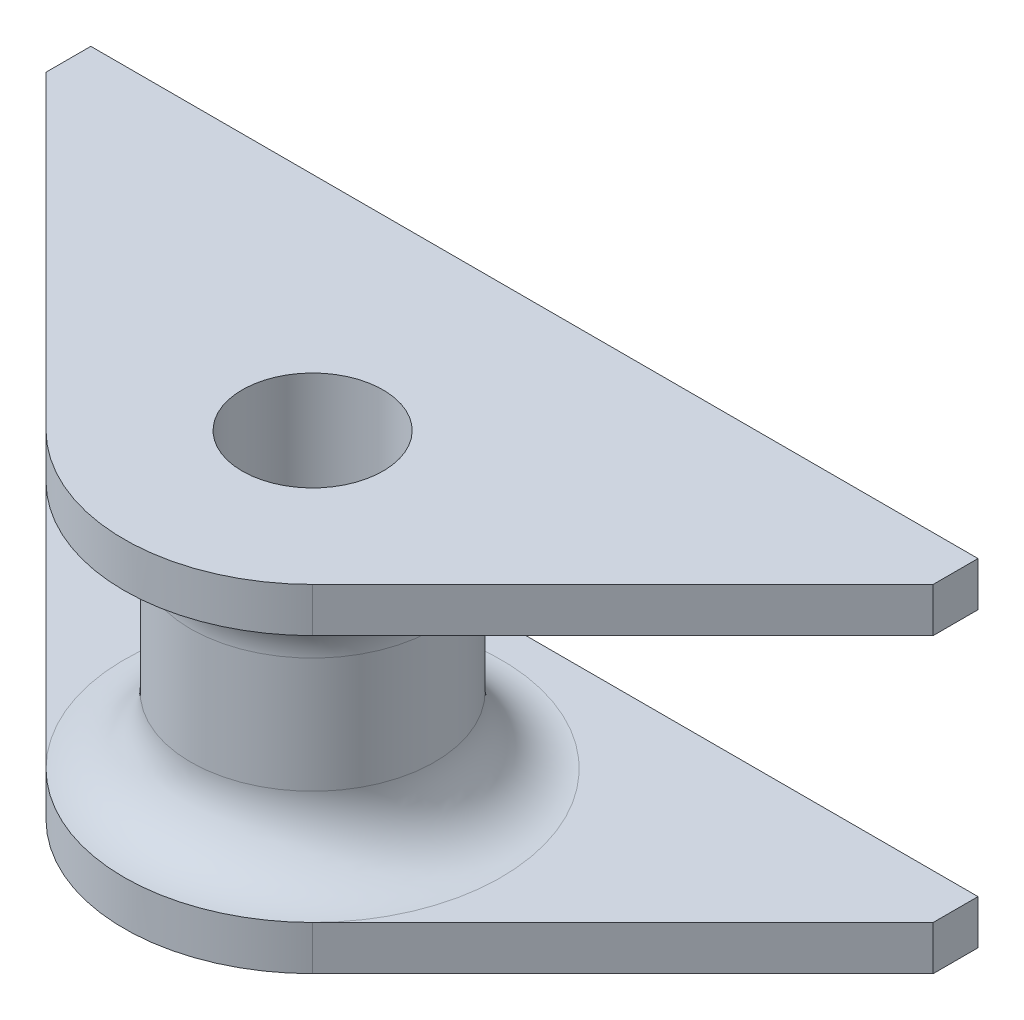
ISO-10303-21;
HEADER;
FILE_DESCRIPTION(('STEP AP214'),'2;1');
FILE_NAME('part.step','',(''),(''),'','','');
FILE_SCHEMA(('AUTOMOTIVE_DESIGN { 1 0 10303 214 1 1 1 1 }'));
ENDSEC;
DATA;
#1=APPLICATION_CONTEXT('core data for automotive mechanical design processes');
#2=APPLICATION_PROTOCOL_DEFINITION('international standard','automotive_design',2000,#1);
#3=PRODUCT_CONTEXT('',#1,'mechanical');
#4=PRODUCT('Part','Part','',(#3));
#5=PRODUCT_RELATED_PRODUCT_CATEGORY('part','',(#4));
#6=PRODUCT_DEFINITION_FORMATION('','',#4);
#7=PRODUCT_DEFINITION_CONTEXT('part definition',#1,'design');
#8=PRODUCT_DEFINITION('design','',#6,#7);
#9=PRODUCT_DEFINITION_SHAPE('','',#8);
#10=(LENGTH_UNIT() NAMED_UNIT(*) SI_UNIT(.MILLI.,.METRE.));
#11=(NAMED_UNIT(*) PLANE_ANGLE_UNIT() SI_UNIT($,.RADIAN.));
#12=(NAMED_UNIT(*) SI_UNIT($,.STERADIAN.) SOLID_ANGLE_UNIT());
#13=UNCERTAINTY_MEASURE_WITH_UNIT(LENGTH_MEASURE(1.E-05),#10,'distance_accuracy_value','');
#14=(GEOMETRIC_REPRESENTATION_CONTEXT(3) GLOBAL_UNCERTAINTY_ASSIGNED_CONTEXT((#13)) GLOBAL_UNIT_ASSIGNED_CONTEXT((#10,
#11,#12)) REPRESENTATION_CONTEXT('',''));
#15=CARTESIAN_POINT('',(0.,0.,0.));
#16=DIRECTION('',(0.,0.,1.));
#17=DIRECTION('',(1.,0.,0.));
#18=AXIS2_PLACEMENT_3D('',#15,#16,#17);
#19=CARTESIAN_POINT('',(0.,-7.6,0.));
#20=DIRECTION('',(0.,1.,0.));
#21=DIRECTION('',(0.,0.,1.));
#22=AXIS2_PLACEMENT_3D('',#19,#20,#21);
#23=CYLINDRICAL_SURFACE('',#22,5.5);
#24=CARTESIAN_POINT('',(0.,2.6,0.));
#25=DIRECTION('',(0.,1.,0.));
#26=DIRECTION('',(0.,0.,1.));
#27=AXIS2_PLACEMENT_3D('',#24,#25,#26);
#28=CIRCLE('',#27,5.5);
#29=CARTESIAN_POINT('',(0.,2.6,5.5));
#30=VERTEX_POINT('',#29);
#31=EDGE_CURVE('E47',#30,#30,#28,.F.);
#32=CARTESIAN_POINT('',(0.,-2.6,0.));
#33=DIRECTION('',(0.,1.,0.));
#34=DIRECTION('',(0.,0.,1.));
#35=AXIS2_PLACEMENT_3D('',#32,#33,#34);
#36=CIRCLE('',#35,5.5);
#37=CARTESIAN_POINT('',(0.,-2.6,5.5));
#38=VERTEX_POINT('',#37);
#39=EDGE_CURVE('E163',#38,#38,#36,.T.);
#40=CARTESIAN_POINT('',(0.,2.6,5.5));
#41=CARTESIAN_POINT('',(0.,2.54583333333333,5.5));
#42=CARTESIAN_POINT('',(0.,2.49166666666667,5.5));
#43=CARTESIAN_POINT('',(0.,2.38333333333333,5.5));
#44=CARTESIAN_POINT('',(0.,2.32916666666667,5.5));
#45=CARTESIAN_POINT('',(0.,2.22083333333333,5.5));
#46=CARTESIAN_POINT('',(0.,2.16666666666667,5.5));
#47=CARTESIAN_POINT('',(0.,2.05833333333333,5.5));
#48=CARTESIAN_POINT('',(0.,2.00416666666667,5.5));
#49=CARTESIAN_POINT('',(0.,1.89583333333333,5.5));
#50=CARTESIAN_POINT('',(0.,1.84166666666667,5.5));
#51=CARTESIAN_POINT('',(0.,1.73333333333333,5.5));
#52=CARTESIAN_POINT('',(0.,1.67916666666667,5.5));
#53=CARTESIAN_POINT('',(0.,1.57083333333333,5.5));
#54=CARTESIAN_POINT('',(0.,1.51666666666667,5.5));
#55=CARTESIAN_POINT('',(0.,1.40833333333333,5.5));
#56=CARTESIAN_POINT('',(0.,1.35416666666667,5.5));
#57=CARTESIAN_POINT('',(0.,1.24583333333333,5.5));
#58=CARTESIAN_POINT('',(0.,1.19166666666667,5.5));
#59=CARTESIAN_POINT('',(0.,1.08333333333333,5.5));
#60=CARTESIAN_POINT('',(0.,1.02916666666666,5.5));
#61=CARTESIAN_POINT('',(0.,0.920833333333331,5.5));
#62=CARTESIAN_POINT('',(0.,0.866666666666665,5.5));
#63=CARTESIAN_POINT('',(0.,0.758333333333332,5.5));
#64=CARTESIAN_POINT('',(0.,0.704166666666665,5.5));
#65=CARTESIAN_POINT('',(0.,0.595833333333332,5.5));
#66=CARTESIAN_POINT('',(0.,0.541666666666666,5.5));
#67=CARTESIAN_POINT('',(0.,0.433333333333332,5.5));
#68=CARTESIAN_POINT('',(0.,0.379166666666665,5.5));
#69=CARTESIAN_POINT('',(0.,0.270833333333332,5.5));
#70=CARTESIAN_POINT('',(0.,0.216666666666666,5.5));
#71=CARTESIAN_POINT('',(0.,0.108333333333333,5.5));
#72=CARTESIAN_POINT('',(0.,0.0541666666666659,5.5));
#73=CARTESIAN_POINT('',(0.,-0.0541666666666677,5.5));
#74=CARTESIAN_POINT('',(0.,-0.108333333333334,5.5));
#75=CARTESIAN_POINT('',(0.,-0.216666666666668,5.5));
#76=CARTESIAN_POINT('',(0.,-0.270833333333334,5.5));
#77=CARTESIAN_POINT('',(0.,-0.379166666666667,5.5));
#78=CARTESIAN_POINT('',(0.,-0.433333333333334,5.5));
#79=CARTESIAN_POINT('',(0.,-0.541666666666668,5.5));
#80=CARTESIAN_POINT('',(0.,-0.595833333333335,5.5));
#81=CARTESIAN_POINT('',(0.,-0.704166666666668,5.5));
#82=CARTESIAN_POINT('',(0.,-0.758333333333334,5.5));
#83=CARTESIAN_POINT('',(0.,-0.866666666666667,5.5));
#84=CARTESIAN_POINT('',(0.,-0.920833333333334,5.5));
#85=CARTESIAN_POINT('',(0.,-1.02916666666667,5.5));
#86=CARTESIAN_POINT('',(0.,-1.08333333333333,5.5));
#87=CARTESIAN_POINT('',(0.,-1.19166666666667,5.5));
#88=CARTESIAN_POINT('',(0.,-1.24583333333333,5.5));
#89=CARTESIAN_POINT('',(0.,-1.35416666666667,5.5));
#90=CARTESIAN_POINT('',(0.,-1.40833333333333,5.5));
#91=CARTESIAN_POINT('',(0.,-1.51666666666667,5.5));
#92=CARTESIAN_POINT('',(0.,-1.57083333333333,5.5));
#93=CARTESIAN_POINT('',(0.,-1.67916666666667,5.5));
#94=CARTESIAN_POINT('',(0.,-1.73333333333333,5.5));
#95=CARTESIAN_POINT('',(0.,-1.84166666666667,5.5));
#96=CARTESIAN_POINT('',(0.,-1.89583333333333,5.5));
#97=CARTESIAN_POINT('',(0.,-2.00416666666667,5.5));
#98=CARTESIAN_POINT('',(0.,-2.05833333333333,5.5));
#99=CARTESIAN_POINT('',(0.,-2.16666666666667,5.5));
#100=CARTESIAN_POINT('',(0.,-2.22083333333333,5.5));
#101=CARTESIAN_POINT('',(0.,-2.32916666666667,5.5));
#102=CARTESIAN_POINT('',(0.,-2.38333333333334,5.5));
#103=CARTESIAN_POINT('',(0.,-2.49166666666667,5.5));
#104=CARTESIAN_POINT('',(0.,-2.54583333333333,5.5));
#105=CARTESIAN_POINT('',(0.,-2.6,5.5));
#106=B_SPLINE_CURVE_WITH_KNOTS('',3,(#40,#41,#42,#43,#44,#45,#46,#47,#48,#49,#50,#51,#52,#53,
#54,#55,#56,#57,#58,#59,#60,#61,#62,#63,#64,#65,#66,#67,#68,#69,#70,#71,#72,#73,#74,#75,#76,#77,
#78,#79,#80,#81,#82,#83,#84,#85,#86,#87,#88,#89,#90,#91,#92,#93,#94,#95,#96,#97,#98,#99,#100,
#101,#102,#103,#104,#105),.UNSPECIFIED.,.F.,.F.,(4,2,2,2,2,2,2,2,2,2,2,2,2,2,2,2,2,2,2,2,2,2,2,
2,2,2,2,2,2,2,2,2,4),(0.,0.162499999999999,0.325000000000001,0.4875,0.65,0.812500000000001,
0.975,1.1375,1.3,1.4625,1.625,1.7875,1.95,2.1125,2.275,2.4375,2.6,2.7625,2.925,3.0875,3.25,
3.4125,3.575,3.7375,3.9,4.0625,4.225,4.3875,4.55,4.7125,4.875,5.0375,5.2),.UNSPECIFIED.);
#107=EDGE_CURVE('BSEAM38',#30,#38,#106,.T.);
#108=ORIENTED_EDGE('',*,*,#31,.T.);
#109=ORIENTED_EDGE('',*,*,#39,.T.);
#110=ORIENTED_EDGE('',*,*,#107,.T.);
#111=ORIENTED_EDGE('',*,*,#107,.F.);
#112=EDGE_LOOP('',(#108,#110,#109,#111));
#113=FACE_BOUND('',#112,.T.);
#114=ADVANCED_FACE('F38',(#113),#23,.T.);
#115=CARTESIAN_POINT('',(0.,-7.6,0.));
#116=DIRECTION('',(0.,1.,0.));
#117=DIRECTION('',(0.,0.,1.));
#118=AXIS2_PLACEMENT_3D('',#115,#116,#117);
#119=PLANE('',#118);
#120=CARTESIAN_POINT('',(0.,-7.6,0.));
#121=DIRECTION('',(0.,1.,0.));
#122=DIRECTION('',(0.,0.,1.));
#123=AXIS2_PLACEMENT_3D('',#120,#121,#122);
#124=CIRCLE('',#123,3.175);
#125=CARTESIAN_POINT('',(0.,-7.6,3.175));
#126=VERTEX_POINT('',#125);
#127=EDGE_CURVE('E158',#126,#126,#124,.T.);
#128=ORIENTED_EDGE('',*,*,#127,.T.);
#129=EDGE_LOOP('',(#128));
#130=FACE_BOUND('',#129,.T.);
#131=CARTESIAN_POINT('',(0.,-7.6,0.));
#132=DIRECTION('',(0.,1.,0.));
#133=DIRECTION('',(0.,0.,1.));
#134=AXIS2_PLACEMENT_3D('',#131,#132,#133);
#135=CIRCLE('',#134,8.5);
#136=CARTESIAN_POINT('',(-6.01040764008566,-7.6,6.01040764008566));
#137=VERTEX_POINT('',#136);
#138=CARTESIAN_POINT('',(6.01040764008566,-7.6,6.01040764008566));
#139=VERTEX_POINT('',#138);
#140=EDGE_CURVE('E286',#137,#139,#135,.T.);
#141=ORIENTED_EDGE('',*,*,#140,.F.);
#142=DIRECTION('',(0.707106781186548,0.,0.707106781186547));
#143=VECTOR('',#142,1.);
#144=CARTESIAN_POINT('',(-20.,-7.6,-7.97918471982869));
#145=LINE('',#144,#143);
#146=CARTESIAN_POINT('',(-20.,-7.6,-7.97918471982869));
#147=VERTEX_POINT('',#146);
#148=EDGE_CURVE('E264',#147,#137,#145,.T.);
#149=ORIENTED_EDGE('',*,*,#148,.F.);
#150=DIRECTION('',(0.,0.,1.));
#151=VECTOR('',#150,1.);
#152=CARTESIAN_POINT('',(-20.,-7.6,-10.));
#153=LINE('',#152,#151);
#154=CARTESIAN_POINT('',(-20.,-7.6,-10.));
#155=VERTEX_POINT('',#154);
#156=EDGE_CURVE('E278',#155,#147,#153,.T.);
#157=ORIENTED_EDGE('',*,*,#156,.F.);
#158=DIRECTION('',(-1.,0.,0.));
#159=VECTOR('',#158,1.);
#160=CARTESIAN_POINT('',(-20.,-7.6,-10.));
#161=LINE('',#160,#159);
#162=CARTESIAN_POINT('',(20.,-7.6,-10.));
#163=VERTEX_POINT('',#162);
#164=EDGE_CURVE('E294',#163,#155,#161,.T.);
#165=ORIENTED_EDGE('',*,*,#164,.F.);
#166=DIRECTION('',(0.,0.,-1.));
#167=VECTOR('',#166,1.);
#168=CARTESIAN_POINT('',(20.,-7.6,-7.97918471982869));
#169=LINE('',#168,#167);
#170=CARTESIAN_POINT('',(20.,-7.6,-7.97918471982869));
#171=VERTEX_POINT('',#170);
#172=EDGE_CURVE('E291',#171,#163,#169,.T.);
#173=ORIENTED_EDGE('',*,*,#172,.F.);
#174=DIRECTION('',(0.707106781186548,0.,-0.707106781186547));
#175=VECTOR('',#174,1.);
#176=CARTESIAN_POINT('',(6.01040764008566,-7.6,6.01040764008566));
#177=LINE('',#176,#175);
#178=EDGE_CURVE('E288',#139,#171,#177,.T.);
#179=ORIENTED_EDGE('',*,*,#178,.F.);
#180=EDGE_LOOP('',(#141,#149,#157,#165,#173,#179));
#181=FACE_BOUND('',#180,.T.);
#182=ADVANCED_FACE('F183',(#130,#181),#119,.F.);
#183=CARTESIAN_POINT('',(0.,-7.6,0.));
#184=DIRECTION('',(0.,1.,0.));
#185=DIRECTION('',(0.,0.,1.));
#186=AXIS2_PLACEMENT_3D('',#183,#184,#185);
#187=CYLINDRICAL_SURFACE('',#186,3.175);
#188=CARTESIAN_POINT('',(0.,7.6,0.));
#189=DIRECTION('',(0.,1.,0.));
#190=DIRECTION('',(0.,0.,1.));
#191=AXIS2_PLACEMENT_3D('',#188,#189,#190);
#192=CIRCLE('',#191,3.175);
#193=CARTESIAN_POINT('',(0.,7.6,3.175));
#194=VERTEX_POINT('',#193);
#195=EDGE_CURVE('E150',#194,#194,#192,.T.);
#196=CARTESIAN_POINT('',(0.,-7.6,3.175));
#197=CARTESIAN_POINT('',(0.,-7.44166666666667,3.175));
#198=CARTESIAN_POINT('',(0.,-7.28333333333333,3.175));
#199=CARTESIAN_POINT('',(0.,-6.96666666666667,3.175));
#200=CARTESIAN_POINT('',(0.,-6.80833333333333,3.175));
#201=CARTESIAN_POINT('',(0.,-6.49166666666667,3.175));
#202=CARTESIAN_POINT('',(0.,-6.33333333333333,3.175));
#203=CARTESIAN_POINT('',(0.,-6.01666666666667,3.175));
#204=CARTESIAN_POINT('',(0.,-5.85833333333333,3.175));
#205=CARTESIAN_POINT('',(0.,-5.54166666666667,3.175));
#206=CARTESIAN_POINT('',(0.,-5.38333333333333,3.175));
#207=CARTESIAN_POINT('',(0.,-5.06666666666667,3.175));
#208=CARTESIAN_POINT('',(0.,-4.90833333333333,3.175));
#209=CARTESIAN_POINT('',(0.,-4.59166666666667,3.175));
#210=CARTESIAN_POINT('',(0.,-4.43333333333333,3.175));
#211=CARTESIAN_POINT('',(0.,-4.11666666666667,3.175));
#212=CARTESIAN_POINT('',(0.,-3.95833333333333,3.175));
#213=CARTESIAN_POINT('',(0.,-3.64166666666667,3.175));
#214=CARTESIAN_POINT('',(0.,-3.48333333333333,3.175));
#215=CARTESIAN_POINT('',(0.,-3.16666666666667,3.175));
#216=CARTESIAN_POINT('',(0.,-3.00833333333333,3.175));
#217=CARTESIAN_POINT('',(0.,-2.69166666666667,3.175));
#218=CARTESIAN_POINT('',(0.,-2.53333333333333,3.175));
#219=CARTESIAN_POINT('',(0.,-2.21666666666667,3.175));
#220=CARTESIAN_POINT('',(0.,-2.05833333333333,3.175));
#221=CARTESIAN_POINT('',(0.,-1.74166666666667,3.175));
#222=CARTESIAN_POINT('',(0.,-1.58333333333333,3.175));
#223=CARTESIAN_POINT('',(0.,-1.26666666666667,3.175));
#224=CARTESIAN_POINT('',(0.,-1.10833333333333,3.175));
#225=CARTESIAN_POINT('',(0.,-0.791666666666667,3.175));
#226=CARTESIAN_POINT('',(0.,-0.633333333333333,3.175));
#227=CARTESIAN_POINT('',(0.,-0.316666666666666,3.175));
#228=CARTESIAN_POINT('',(0.,-0.158333333333333,3.175));
#229=CARTESIAN_POINT('',(0.,0.158333333333333,3.175));
#230=CARTESIAN_POINT('',(0.,0.316666666666666,3.175));
#231=CARTESIAN_POINT('',(0.,0.633333333333332,3.175));
#232=CARTESIAN_POINT('',(0.,0.791666666666665,3.175));
#233=CARTESIAN_POINT('',(0.,1.10833333333333,3.175));
#234=CARTESIAN_POINT('',(0.,1.26666666666667,3.175));
#235=CARTESIAN_POINT('',(0.,1.58333333333333,3.175));
#236=CARTESIAN_POINT('',(0.,1.74166666666667,3.175));
#237=CARTESIAN_POINT('',(0.,2.05833333333333,3.175));
#238=CARTESIAN_POINT('',(0.,2.21666666666667,3.175));
#239=CARTESIAN_POINT('',(0.,2.53333333333333,3.175));
#240=CARTESIAN_POINT('',(0.,2.69166666666667,3.175));
#241=CARTESIAN_POINT('',(0.,3.00833333333333,3.175));
#242=CARTESIAN_POINT('',(0.,3.16666666666667,3.175));
#243=CARTESIAN_POINT('',(0.,3.48333333333333,3.175));
#244=CARTESIAN_POINT('',(0.,3.64166666666667,3.175));
#245=CARTESIAN_POINT('',(0.,3.95833333333333,3.175));
#246=CARTESIAN_POINT('',(0.,4.11666666666667,3.175));
#247=CARTESIAN_POINT('',(0.,4.43333333333333,3.175));
#248=CARTESIAN_POINT('',(0.,4.59166666666667,3.175));
#249=CARTESIAN_POINT('',(0.,4.90833333333333,3.175));
#250=CARTESIAN_POINT('',(0.,5.06666666666667,3.175));
#251=CARTESIAN_POINT('',(0.,5.38333333333333,3.175));
#252=CARTESIAN_POINT('',(0.,5.54166666666667,3.175));
#253=CARTESIAN_POINT('',(0.,5.85833333333333,3.175));
#254=CARTESIAN_POINT('',(0.,6.01666666666667,3.175));
#255=CARTESIAN_POINT('',(0.,6.33333333333333,3.175));
#256=CARTESIAN_POINT('',(0.,6.49166666666667,3.175));
#257=CARTESIAN_POINT('',(0.,6.80833333333333,3.175));
#258=CARTESIAN_POINT('',(0.,6.96666666666667,3.175));
#259=CARTESIAN_POINT('',(0.,7.28333333333333,3.175));
#260=CARTESIAN_POINT('',(0.,7.44166666666667,3.175));
#261=CARTESIAN_POINT('',(0.,7.6,3.175));
#262=B_SPLINE_CURVE_WITH_KNOTS('',3,(#196,#197,#198,#199,#200,#201,#202,#203,#204,#205,#206,
#207,#208,#209,#210,#211,#212,#213,#214,#215,#216,#217,#218,#219,#220,#221,#222,#223,#224,#225,
#226,#227,#228,#229,#230,#231,#232,#233,#234,#235,#236,#237,#238,#239,#240,#241,#242,#243,#244,
#245,#246,#247,#248,#249,#250,#251,#252,#253,#254,#255,#256,#257,#258,#259,#260,#261),
.UNSPECIFIED.,.F.,.F.,(4,2,2,2,2,2,2,2,2,2,2,2,2,2,2,2,2,2,2,2,2,2,2,2,2,2,2,2,2,2,2,2,4),(0.,
0.475,0.95,1.425,1.9,2.375,2.85,3.325,3.8,4.275,4.75,5.225,5.7,6.175,6.65,7.125,7.6,8.075,8.55,
9.025,9.5,9.975,10.45,10.925,11.4,11.875,12.35,12.825,13.3,13.775,14.25,14.725,15.2),.UNSPECIFIED.);
#263=EDGE_CURVE('BSEAM187',#126,#194,#262,.T.);
#264=ORIENTED_EDGE('',*,*,#127,.F.);
#265=ORIENTED_EDGE('',*,*,#195,.T.);
#266=ORIENTED_EDGE('',*,*,#263,.T.);
#267=ORIENTED_EDGE('',*,*,#263,.F.);
#268=EDGE_LOOP('',(#264,#266,#265,#267));
#269=FACE_BOUND('',#268,.T.);
#270=ADVANCED_FACE('F187',(#269),#187,.F.);
#271=CARTESIAN_POINT('',(0.,7.6,0.));
#272=DIRECTION('',(0.,1.,0.));
#273=DIRECTION('',(0.,0.,1.));
#274=AXIS2_PLACEMENT_3D('',#271,#272,#273);
#275=PLANE('',#274);
#276=ORIENTED_EDGE('',*,*,#195,.F.);
#277=EDGE_LOOP('',(#276));
#278=FACE_BOUND('',#277,.T.);
#279=CARTESIAN_POINT('',(0.,7.6,0.));
#280=DIRECTION('',(0.,1.,0.));
#281=DIRECTION('',(0.,0.,1.));
#282=AXIS2_PLACEMENT_3D('',#279,#280,#281);
#283=CIRCLE('',#282,8.5);
#284=CARTESIAN_POINT('',(-6.01040764008566,7.6,6.01040764008566));
#285=VERTEX_POINT('',#284);
#286=CARTESIAN_POINT('',(6.01040764008566,7.6,6.01040764008566));
#287=VERTEX_POINT('',#286);
#288=EDGE_CURVE('E133',#285,#287,#283,.T.);
#289=ORIENTED_EDGE('',*,*,#288,.T.);
#290=DIRECTION('',(0.707106781186548,0.,-0.707106781186547));
#291=VECTOR('',#290,1.);
#292=CARTESIAN_POINT('',(6.01040764008566,7.6,6.01040764008566));
#293=LINE('',#292,#291);
#294=CARTESIAN_POINT('',(20.,7.6,-7.97918471982869));
#295=VERTEX_POINT('',#294);
#296=EDGE_CURVE('E136',#287,#295,#293,.T.);
#297=ORIENTED_EDGE('',*,*,#296,.T.);
#298=DIRECTION('',(0.,0.,-1.));
#299=VECTOR('',#298,1.);
#300=CARTESIAN_POINT('',(20.,7.6,-7.97918471982869));
#301=LINE('',#300,#299);
#302=CARTESIAN_POINT('',(20.,7.6,-10.));
#303=VERTEX_POINT('',#302);
#304=EDGE_CURVE('E140',#295,#303,#301,.T.);
#305=ORIENTED_EDGE('',*,*,#304,.T.);
#306=DIRECTION('',(-1.,0.,0.));
#307=VECTOR('',#306,1.);
#308=CARTESIAN_POINT('',(-20.,7.6,-10.));
#309=LINE('',#308,#307);
#310=CARTESIAN_POINT('',(-20.,7.6,-10.));
#311=VERTEX_POINT('',#310);
#312=EDGE_CURVE('E143',#303,#311,#309,.T.);
#313=ORIENTED_EDGE('',*,*,#312,.T.);
#314=DIRECTION('',(0.,0.,1.));
#315=VECTOR('',#314,1.);
#316=CARTESIAN_POINT('',(-20.,7.6,-10.));
#317=LINE('',#316,#315);
#318=CARTESIAN_POINT('',(-20.,7.6,-7.97918471982869));
#319=VERTEX_POINT('',#318);
#320=EDGE_CURVE('E110',#311,#319,#317,.T.);
#321=ORIENTED_EDGE('',*,*,#320,.T.);
#322=DIRECTION('',(0.707106781186548,0.,0.707106781186547));
#323=VECTOR('',#322,1.);
#324=CARTESIAN_POINT('',(-20.,7.6,-7.97918471982869));
#325=LINE('',#324,#323);
#326=EDGE_CURVE('E146',#319,#285,#325,.T.);
#327=ORIENTED_EDGE('',*,*,#326,.T.);
#328=EDGE_LOOP('',(#289,#297,#305,#313,#321,#327));
#329=FACE_BOUND('',#328,.T.);
#330=ADVANCED_FACE('F193',(#278,#329),#275,.T.);
#331=CARTESIAN_POINT('',(0.,5.6,0.));
#332=DIRECTION('',(0.,1.,0.));
#333=DIRECTION('',(0.,0.,1.));
#334=AXIS2_PLACEMENT_3D('',#331,#332,#333);
#335=CYLINDRICAL_SURFACE('',#334,8.5);
#336=ORIENTED_EDGE('',*,*,#288,.F.);
#337=DIRECTION('',(0.,1.,0.));
#338=VECTOR('',#337,1.);
#339=CARTESIAN_POINT('',(-6.01040764008566,5.6,6.01040764008566));
#340=LINE('',#339,#338);
#341=CARTESIAN_POINT('',(-6.01040764008566,5.6,6.01040764008566));
#342=VERTEX_POINT('',#341);
#343=EDGE_CURVE('E86',#342,#285,#340,.T.);
#344=ORIENTED_EDGE('',*,*,#343,.F.);
#345=CARTESIAN_POINT('',(0.,5.6,0.));
#346=DIRECTION('',(0.,1.,0.));
#347=DIRECTION('',(0.,0.,1.));
#348=AXIS2_PLACEMENT_3D('',#345,#346,#347);
#349=CIRCLE('',#348,8.5);
#350=CARTESIAN_POINT('',(6.01040764008566,5.6,6.01040764008566));
#351=VERTEX_POINT('',#350);
#352=EDGE_CURVE('E54',#342,#351,#349,.T.);
#353=ORIENTED_EDGE('',*,*,#352,.T.);
#354=DIRECTION('',(0.,1.,0.));
#355=VECTOR('',#354,1.);
#356=CARTESIAN_POINT('',(6.01040764008566,5.6,6.01040764008566));
#357=LINE('',#356,#355);
#358=EDGE_CURVE('E94',#351,#287,#357,.T.);
#359=ORIENTED_EDGE('',*,*,#358,.T.);
#360=EDGE_LOOP('',(#336,#344,#353,#359));
#361=FACE_BOUND('',#360,.T.);
#362=ADVANCED_FACE('F197',(#361),#335,.T.);
#363=CARTESIAN_POINT('',(-20.,5.6,-7.97918471982869));
#364=DIRECTION('',(-0.707106781186547,0.,0.707106781186548));
#365=DIRECTION('',(0.707106781186548,0.,0.707106781186547));
#366=AXIS2_PLACEMENT_3D('',#363,#364,#365);
#367=PLANE('',#366);
#368=ORIENTED_EDGE('',*,*,#326,.F.);
#369=DIRECTION('',(0.,1.,0.));
#370=VECTOR('',#369,1.);
#371=CARTESIAN_POINT('',(-20.,5.6,-7.97918471982869));
#372=LINE('',#371,#370);
#373=CARTESIAN_POINT('',(-20.,5.6,-7.97918471982869));
#374=VERTEX_POINT('',#373);
#375=EDGE_CURVE('E78',#374,#319,#372,.T.);
#376=ORIENTED_EDGE('',*,*,#375,.F.);
#377=DIRECTION('',(0.707106781186548,0.,0.707106781186547));
#378=VECTOR('',#377,1.);
#379=CARTESIAN_POINT('',(-20.,5.6,-7.97918471982869));
#380=LINE('',#379,#378);
#381=EDGE_CURVE('E123',#374,#342,#380,.T.);
#382=ORIENTED_EDGE('',*,*,#381,.T.);
#383=ORIENTED_EDGE('',*,*,#343,.T.);
#384=EDGE_LOOP('',(#368,#376,#382,#383));
#385=FACE_BOUND('',#384,.T.);
#386=ADVANCED_FACE('F201',(#385),#367,.T.);
#387=CARTESIAN_POINT('',(-20.,5.6,-10.));
#388=DIRECTION('',(-1.,0.,0.));
#389=DIRECTION('',(0.,0.,1.));
#390=AXIS2_PLACEMENT_3D('',#387,#388,#389);
#391=PLANE('',#390);
#392=ORIENTED_EDGE('',*,*,#320,.F.);
#393=DIRECTION('',(0.,1.,0.));
#394=VECTOR('',#393,1.);
#395=CARTESIAN_POINT('',(-20.,5.6,-10.));
#396=LINE('',#395,#394);
#397=CARTESIAN_POINT('',(-20.,5.6,-10.));
#398=VERTEX_POINT('',#397);
#399=EDGE_CURVE('E105',#398,#311,#396,.T.);
#400=ORIENTED_EDGE('',*,*,#399,.F.);
#401=DIRECTION('',(0.,0.,1.));
#402=VECTOR('',#401,1.);
#403=CARTESIAN_POINT('',(-20.,5.6,-10.));
#404=LINE('',#403,#402);
#405=EDGE_CURVE('E108',#398,#374,#404,.T.);
#406=ORIENTED_EDGE('',*,*,#405,.T.);
#407=ORIENTED_EDGE('',*,*,#375,.T.);
#408=EDGE_LOOP('',(#392,#400,#406,#407));
#409=FACE_BOUND('',#408,.T.);
#410=ADVANCED_FACE('F107',(#409),#391,.T.);
#411=CARTESIAN_POINT('',(-20.,5.6,-10.));
#412=DIRECTION('',(0.,0.,-1.));
#413=DIRECTION('',(-1.,0.,0.));
#414=AXIS2_PLACEMENT_3D('',#411,#412,#413);
#415=PLANE('',#414);
#416=ORIENTED_EDGE('',*,*,#312,.F.);
#417=DIRECTION('',(0.,1.,0.));
#418=VECTOR('',#417,1.);
#419=CARTESIAN_POINT('',(20.,5.6,-10.));
#420=LINE('',#419,#418);
#421=CARTESIAN_POINT('',(20.,5.6,-10.));
#422=VERTEX_POINT('',#421);
#423=EDGE_CURVE('E115',#422,#303,#420,.T.);
#424=ORIENTED_EDGE('',*,*,#423,.F.);
#425=DIRECTION('',(-1.,0.,0.));
#426=VECTOR('',#425,1.);
#427=CARTESIAN_POINT('',(-20.,5.6,-10.));
#428=LINE('',#427,#426);
#429=EDGE_CURVE('E121',#422,#398,#428,.T.);
#430=ORIENTED_EDGE('',*,*,#429,.T.);
#431=ORIENTED_EDGE('',*,*,#399,.T.);
#432=EDGE_LOOP('',(#416,#424,#430,#431));
#433=FACE_BOUND('',#432,.T.);
#434=ADVANCED_FACE('F125',(#433),#415,.T.);
#435=CARTESIAN_POINT('',(20.,5.6,-7.97918471982869));
#436=DIRECTION('',(1.,0.,0.));
#437=DIRECTION('',(0.,0.,-1.));
#438=AXIS2_PLACEMENT_3D('',#435,#436,#437);
#439=PLANE('',#438);
#440=ORIENTED_EDGE('',*,*,#304,.F.);
#441=DIRECTION('',(0.,1.,0.));
#442=VECTOR('',#441,1.);
#443=CARTESIAN_POINT('',(20.,5.6,-7.97918471982869));
#444=LINE('',#443,#442);
#445=CARTESIAN_POINT('',(20.,5.6,-7.97918471982869));
#446=VERTEX_POINT('',#445);
#447=EDGE_CURVE('E153',#446,#295,#444,.T.);
#448=ORIENTED_EDGE('',*,*,#447,.F.);
#449=DIRECTION('',(0.,0.,-1.));
#450=VECTOR('',#449,1.);
#451=CARTESIAN_POINT('',(20.,5.6,-7.97918471982869));
#452=LINE('',#451,#450);
#453=EDGE_CURVE('E126',#446,#422,#452,.T.);
#454=ORIENTED_EDGE('',*,*,#453,.T.);
#455=ORIENTED_EDGE('',*,*,#423,.T.);
#456=EDGE_LOOP('',(#440,#448,#454,#455));
#457=FACE_BOUND('',#456,.T.);
#458=ADVANCED_FACE('F206',(#457),#439,.T.);
#459=CARTESIAN_POINT('',(6.01040764008566,5.6,6.01040764008566));
#460=DIRECTION('',(0.707106781186547,0.,0.707106781186548));
#461=DIRECTION('',(0.707106781186548,0.,-0.707106781186547));
#462=AXIS2_PLACEMENT_3D('',#459,#460,#461);
#463=PLANE('',#462);
#464=ORIENTED_EDGE('',*,*,#296,.F.);
#465=ORIENTED_EDGE('',*,*,#358,.F.);
#466=DIRECTION('',(0.707106781186548,0.,-0.707106781186547));
#467=VECTOR('',#466,1.);
#468=CARTESIAN_POINT('',(6.01040764008566,5.6,6.01040764008566));
#469=LINE('',#468,#467);
#470=EDGE_CURVE('E128',#351,#446,#469,.T.);
#471=ORIENTED_EDGE('',*,*,#470,.T.);
#472=ORIENTED_EDGE('',*,*,#447,.T.);
#473=EDGE_LOOP('',(#464,#465,#471,#472));
#474=FACE_BOUND('',#473,.T.);
#475=ADVANCED_FACE('F203',(#474),#463,.T.);
#476=CARTESIAN_POINT('',(0.,5.6,0.));
#477=DIRECTION('',(0.,1.,0.));
#478=DIRECTION('',(0.,0.,1.));
#479=AXIS2_PLACEMENT_3D('',#476,#477,#478);
#480=PLANE('',#479);
#481=ORIENTED_EDGE('',*,*,#470,.F.);
#482=CARTESIAN_POINT('',(0.,5.6,0.));
#483=DIRECTION('',(0.,1.,0.));
#484=DIRECTION('',(0.,0.,1.));
#485=AXIS2_PLACEMENT_3D('',#482,#483,#484);
#486=CIRCLE('',#485,8.5);
#487=EDGE_CURVE('E161',#351,#342,#486,.T.);
#488=ORIENTED_EDGE('',*,*,#487,.T.);
#489=ORIENTED_EDGE('',*,*,#381,.F.);
#490=ORIENTED_EDGE('',*,*,#405,.F.);
#491=ORIENTED_EDGE('',*,*,#429,.F.);
#492=ORIENTED_EDGE('',*,*,#453,.F.);
#493=EDGE_LOOP('',(#481,#488,#489,#490,#491,#492));
#494=FACE_BOUND('',#493,.T.);
#495=ADVANCED_FACE('F119',(#494),#480,.F.);
#496=CARTESIAN_POINT('',(0.,-5.6,0.));
#497=DIRECTION('',(0.,1.,0.));
#498=DIRECTION('',(0.,0.,1.));
#499=AXIS2_PLACEMENT_3D('',#496,#497,#498);
#500=PLANE('',#499);
#501=DIRECTION('',(0.707106781186548,0.,0.707106781186547));
#502=VECTOR('',#501,1.);
#503=CARTESIAN_POINT('',(-20.,-5.6,-7.97918471982869));
#504=LINE('',#503,#502);
#505=CARTESIAN_POINT('',(-20.,-5.6,-7.97918471982869));
#506=VERTEX_POINT('',#505);
#507=CARTESIAN_POINT('',(-6.01040764008566,-5.6,6.01040764008566));
#508=VERTEX_POINT('',#507);
#509=EDGE_CURVE('E245',#506,#508,#504,.T.);
#510=ORIENTED_EDGE('',*,*,#509,.T.);
#511=CARTESIAN_POINT('',(0.,-5.6,0.));
#512=DIRECTION('',(0.,1.,0.));
#513=DIRECTION('',(0.,0.,1.));
#514=AXIS2_PLACEMENT_3D('',#511,#512,#513);
#515=CIRCLE('',#514,8.5);
#516=CARTESIAN_POINT('',(6.01040764008566,-5.6,6.01040764008566));
#517=VERTEX_POINT('',#516);
#518=EDGE_CURVE('E11',#508,#517,#515,.F.);
#519=ORIENTED_EDGE('',*,*,#518,.T.);
#520=DIRECTION('',(0.707106781186548,0.,-0.707106781186547));
#521=VECTOR('',#520,1.);
#522=CARTESIAN_POINT('',(6.01040764008566,-5.6,6.01040764008566));
#523=LINE('',#522,#521);
#524=CARTESIAN_POINT('',(20.,-5.6,-7.97918471982869));
#525=VERTEX_POINT('',#524);
#526=EDGE_CURVE('E274',#517,#525,#523,.T.);
#527=ORIENTED_EDGE('',*,*,#526,.T.);
#528=DIRECTION('',(0.,0.,-1.));
#529=VECTOR('',#528,1.);
#530=CARTESIAN_POINT('',(20.,-5.6,-7.97918471982869));
#531=LINE('',#530,#529);
#532=CARTESIAN_POINT('',(20.,-5.6,-10.));
#533=VERTEX_POINT('',#532);
#534=EDGE_CURVE('E276',#525,#533,#531,.T.);
#535=ORIENTED_EDGE('',*,*,#534,.T.);
#536=DIRECTION('',(-1.,0.,0.));
#537=VECTOR('',#536,1.);
#538=CARTESIAN_POINT('',(-20.,-5.6,-10.));
#539=LINE('',#538,#537);
#540=CARTESIAN_POINT('',(-20.,-5.6,-10.));
#541=VERTEX_POINT('',#540);
#542=EDGE_CURVE('E283',#533,#541,#539,.T.);
#543=ORIENTED_EDGE('',*,*,#542,.T.);
#544=DIRECTION('',(0.,0.,1.));
#545=VECTOR('',#544,1.);
#546=CARTESIAN_POINT('',(-20.,-5.6,-10.));
#547=LINE('',#546,#545);
#548=EDGE_CURVE('E254',#541,#506,#547,.T.);
#549=ORIENTED_EDGE('',*,*,#548,.T.);
#550=EDGE_LOOP('',(#510,#519,#527,#535,#543,#549));
#551=FACE_BOUND('',#550,.T.);
#552=ADVANCED_FACE('F218',(#551),#500,.T.);
#553=CARTESIAN_POINT('',(0.,-5.6,0.));
#554=DIRECTION('',(0.,-1.,0.));
#555=DIRECTION('',(0.,0.,-1.));
#556=AXIS2_PLACEMENT_3D('',#553,#554,#555);
#557=CYLINDRICAL_SURFACE('',#556,8.5);
#558=ORIENTED_EDGE('',*,*,#140,.T.);
#559=DIRECTION('',(0.,-1.,0.));
#560=VECTOR('',#559,1.);
#561=CARTESIAN_POINT('',(6.01040764008566,-5.6,6.01040764008566));
#562=LINE('',#561,#560);
#563=EDGE_CURVE('E137',#517,#139,#562,.T.);
#564=ORIENTED_EDGE('',*,*,#563,.F.);
#565=CARTESIAN_POINT('',(0.,-5.6,0.));
#566=DIRECTION('',(0.,1.,0.));
#567=DIRECTION('',(0.,0.,1.));
#568=AXIS2_PLACEMENT_3D('',#565,#566,#567);
#569=CIRCLE('',#568,8.5);
#570=EDGE_CURVE('E271',#508,#517,#569,.T.);
#571=ORIENTED_EDGE('',*,*,#570,.F.);
#572=DIRECTION('',(0.,-1.,0.));
#573=VECTOR('',#572,1.);
#574=CARTESIAN_POINT('',(-6.01040764008566,-5.6,6.01040764008566));
#575=LINE('',#574,#573);
#576=EDGE_CURVE('E258',#508,#137,#575,.T.);
#577=ORIENTED_EDGE('',*,*,#576,.T.);
#578=EDGE_LOOP('',(#558,#564,#571,#577));
#579=FACE_BOUND('',#578,.T.);
#580=ADVANCED_FACE('F219',(#579),#557,.T.);
#581=CARTESIAN_POINT('',(6.01040764008566,-5.6,6.01040764008566));
#582=DIRECTION('',(-0.707106781186547,0.,-0.707106781186548));
#583=DIRECTION('',(-0.707106781186548,0.,0.707106781186547));
#584=AXIS2_PLACEMENT_3D('',#581,#582,#583);
#585=PLANE('',#584);
#586=ORIENTED_EDGE('',*,*,#178,.T.);
#587=DIRECTION('',(0.,-1.,0.));
#588=VECTOR('',#587,1.);
#589=CARTESIAN_POINT('',(20.,-5.6,-7.97918471982869));
#590=LINE('',#589,#588);
#591=EDGE_CURVE('E306',#525,#171,#590,.T.);
#592=ORIENTED_EDGE('',*,*,#591,.F.);
#593=ORIENTED_EDGE('',*,*,#526,.F.);
#594=ORIENTED_EDGE('',*,*,#563,.T.);
#595=EDGE_LOOP('',(#586,#592,#593,#594));
#596=FACE_BOUND('',#595,.T.);
#597=ADVANCED_FACE('F222',(#596),#585,.F.);
#598=CARTESIAN_POINT('',(20.,-5.6,-7.97918471982869));
#599=DIRECTION('',(-1.,0.,0.));
#600=DIRECTION('',(0.,0.,1.));
#601=AXIS2_PLACEMENT_3D('',#598,#599,#600);
#602=PLANE('',#601);
#603=ORIENTED_EDGE('',*,*,#172,.T.);
#604=DIRECTION('',(0.,-1.,0.));
#605=VECTOR('',#604,1.);
#606=CARTESIAN_POINT('',(20.,-5.6,-10.));
#607=LINE('',#606,#605);
#608=EDGE_CURVE('E303',#533,#163,#607,.T.);
#609=ORIENTED_EDGE('',*,*,#608,.F.);
#610=ORIENTED_EDGE('',*,*,#534,.F.);
#611=ORIENTED_EDGE('',*,*,#591,.T.);
#612=EDGE_LOOP('',(#603,#609,#610,#611));
#613=FACE_BOUND('',#612,.T.);
#614=ADVANCED_FACE('F226',(#613),#602,.F.);
#615=CARTESIAN_POINT('',(-20.,-5.6,-10.));
#616=DIRECTION('',(0.,0.,1.));
#617=DIRECTION('',(1.,0.,0.));
#618=AXIS2_PLACEMENT_3D('',#615,#616,#617);
#619=PLANE('',#618);
#620=ORIENTED_EDGE('',*,*,#164,.T.);
#621=DIRECTION('',(0.,-1.,0.));
#622=VECTOR('',#621,1.);
#623=CARTESIAN_POINT('',(-20.,-5.6,-10.));
#624=LINE('',#623,#622);
#625=EDGE_CURVE('E300',#541,#155,#624,.T.);
#626=ORIENTED_EDGE('',*,*,#625,.F.);
#627=ORIENTED_EDGE('',*,*,#542,.F.);
#628=ORIENTED_EDGE('',*,*,#608,.T.);
#629=EDGE_LOOP('',(#620,#626,#627,#628));
#630=FACE_BOUND('',#629,.T.);
#631=ADVANCED_FACE('F230',(#630),#619,.F.);
#632=CARTESIAN_POINT('',(-20.,-5.6,-10.));
#633=DIRECTION('',(1.,0.,0.));
#634=DIRECTION('',(0.,0.,-1.));
#635=AXIS2_PLACEMENT_3D('',#632,#633,#634);
#636=PLANE('',#635);
#637=ORIENTED_EDGE('',*,*,#156,.T.);
#638=DIRECTION('',(0.,-1.,0.));
#639=VECTOR('',#638,1.);
#640=CARTESIAN_POINT('',(-20.,-5.6,-7.97918471982869));
#641=LINE('',#640,#639);
#642=EDGE_CURVE('E267',#506,#147,#641,.T.);
#643=ORIENTED_EDGE('',*,*,#642,.F.);
#644=ORIENTED_EDGE('',*,*,#548,.F.);
#645=ORIENTED_EDGE('',*,*,#625,.T.);
#646=EDGE_LOOP('',(#637,#643,#644,#645));
#647=FACE_BOUND('',#646,.T.);
#648=ADVANCED_FACE('F178',(#647),#636,.F.);
#649=CARTESIAN_POINT('',(-20.,-5.6,-7.97918471982869));
#650=DIRECTION('',(0.707106781186547,0.,-0.707106781186548));
#651=DIRECTION('',(-0.707106781186548,0.,-0.707106781186547));
#652=AXIS2_PLACEMENT_3D('',#649,#650,#651);
#653=PLANE('',#652);
#654=ORIENTED_EDGE('',*,*,#148,.T.);
#655=ORIENTED_EDGE('',*,*,#576,.F.);
#656=ORIENTED_EDGE('',*,*,#509,.F.);
#657=ORIENTED_EDGE('',*,*,#642,.T.);
#658=EDGE_LOOP('',(#654,#655,#656,#657));
#659=FACE_BOUND('',#658,.T.);
#660=ADVANCED_FACE('F172',(#659),#653,.F.);
#661=CARTESIAN_POINT('',(0.,2.6,0.));
#662=DIRECTION('',(0.,1.,0.));
#663=DIRECTION('',(0.,0.,1.));
#664=AXIS2_PLACEMENT_3D('',#661,#662,#663);
#665=TOROIDAL_SURFACE('',#664,8.5,3.);
#666=ORIENTED_EDGE('',*,*,#31,.F.);
#667=EDGE_LOOP('',(#666));
#668=FACE_BOUND('',#667,.T.);
#669=ORIENTED_EDGE('',*,*,#352,.F.);
#670=ORIENTED_EDGE('',*,*,#487,.F.);
#671=EDGE_LOOP('',(#669,#670));
#672=FACE_BOUND('',#671,.T.);
#673=ADVANCED_FACE('F170',(#668,#672),#665,.F.);
#674=CARTESIAN_POINT('',(0.,-2.6,0.));
#675=DIRECTION('',(0.,1.,0.));
#676=DIRECTION('',(0.,0.,1.));
#677=AXIS2_PLACEMENT_3D('',#674,#675,#676);
#678=TOROIDAL_SURFACE('',#677,8.5,3.);
#679=ORIENTED_EDGE('',*,*,#39,.F.);
#680=EDGE_LOOP('',(#679));
#681=FACE_BOUND('',#680,.T.);
#682=ORIENTED_EDGE('',*,*,#570,.T.);
#683=ORIENTED_EDGE('',*,*,#518,.F.);
#684=EDGE_LOOP('',(#682,#683));
#685=FACE_BOUND('',#684,.T.);
#686=ADVANCED_FACE('F40',(#681,#685),#678,.F.);
#687=CLOSED_SHELL('',(#114,#182,#270,#330,#362,#386,#410,#434,#458,#475,#495,#552,#580,#597,
#614,#631,#648,#660,#673,#686));
#688=MANIFOLD_SOLID_BREP('B2',#687);
#689=ADVANCED_BREP_SHAPE_REPRESENTATION('',(#18,#688),#14);
#690=SHAPE_DEFINITION_REPRESENTATION(#9,#689);
ENDSEC;
END-ISO-10303-21;
